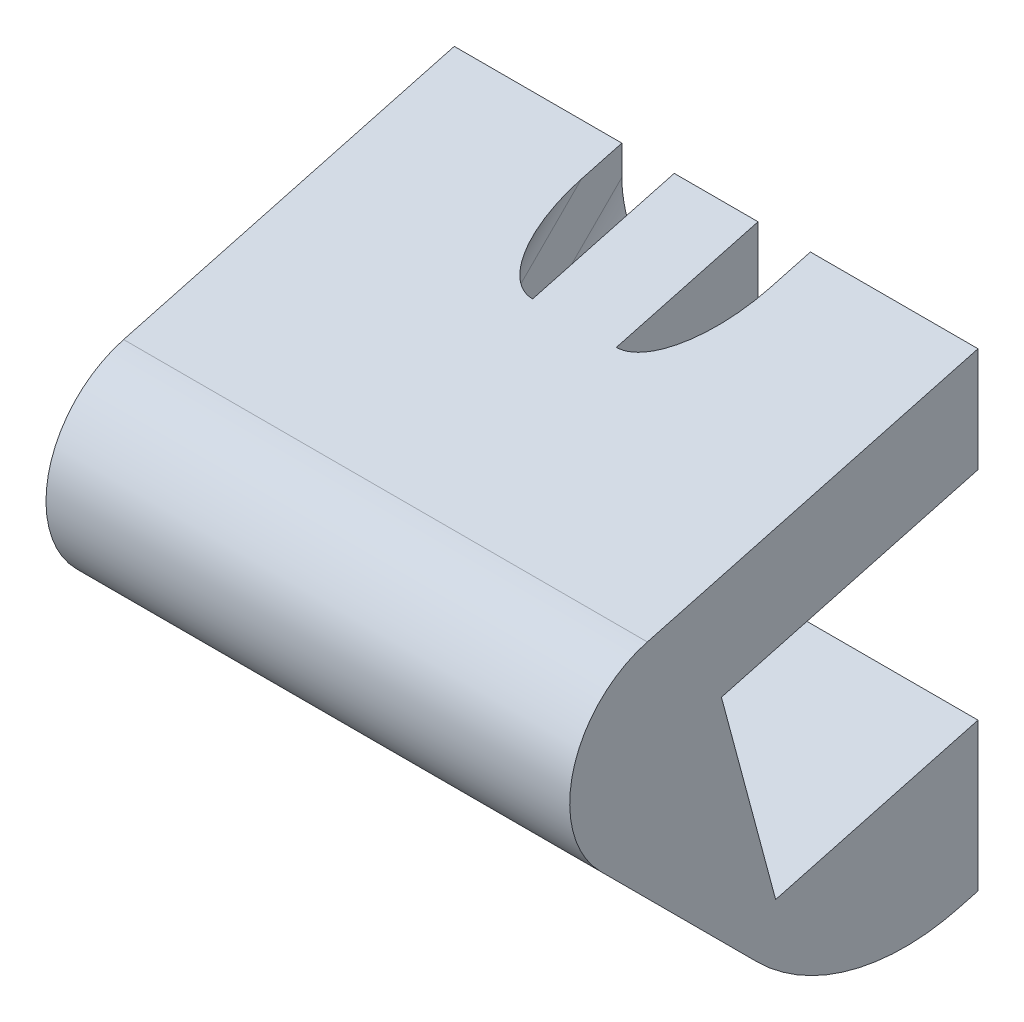
ISO-10303-21;
HEADER;
FILE_DESCRIPTION(('STEP AP214'),'2;1');
FILE_NAME('part.step','',(''),(''),'','','');
FILE_SCHEMA(('AUTOMOTIVE_DESIGN { 1 0 10303 214 1 1 1 1 }'));
ENDSEC;
DATA;
#1=APPLICATION_CONTEXT('core data for automotive mechanical design processes');
#2=APPLICATION_PROTOCOL_DEFINITION('international standard','automotive_design',2000,#1);
#3=PRODUCT_CONTEXT('',#1,'mechanical');
#4=PRODUCT('Part','Part','',(#3));
#5=PRODUCT_RELATED_PRODUCT_CATEGORY('part','',(#4));
#6=PRODUCT_DEFINITION_FORMATION('','',#4);
#7=PRODUCT_DEFINITION_CONTEXT('part definition',#1,'design');
#8=PRODUCT_DEFINITION('design','',#6,#7);
#9=PRODUCT_DEFINITION_SHAPE('','',#8);
#10=(LENGTH_UNIT() NAMED_UNIT(*) SI_UNIT(.MILLI.,.METRE.));
#11=(NAMED_UNIT(*) PLANE_ANGLE_UNIT() SI_UNIT($,.RADIAN.));
#12=(NAMED_UNIT(*) SI_UNIT($,.STERADIAN.) SOLID_ANGLE_UNIT());
#13=UNCERTAINTY_MEASURE_WITH_UNIT(LENGTH_MEASURE(1.E-05),#10,'distance_accuracy_value','');
#14=(GEOMETRIC_REPRESENTATION_CONTEXT(3) GLOBAL_UNCERTAINTY_ASSIGNED_CONTEXT((#13)) GLOBAL_UNIT_ASSIGNED_CONTEXT((#10,
#11,#12)) REPRESENTATION_CONTEXT('',''));
#15=CARTESIAN_POINT('',(0.,0.,0.));
#16=DIRECTION('',(0.,0.,1.));
#17=DIRECTION('',(1.,0.,0.));
#18=AXIS2_PLACEMENT_3D('',#15,#16,#17);
#19=CARTESIAN_POINT('',(4.064,-4.60180262192282,7.3603547963227));
#20=DIRECTION('',(1.,0.,0.));
#21=DIRECTION('',(0.,0.,-1.));
#22=AXIS2_PLACEMENT_3D('',#19,#20,#21);
#23=PLANE('',#22);
#24=DIRECTION('',(0.,0.258819045102521,-0.965925826289068));
#25=VECTOR('',#24,1.);
#26=CARTESIAN_POINT('',(4.064,0.,0.));
#27=LINE('',#26,#25);
#28=CARTESIAN_POINT('',(4.064,-0.262960149824156,0.98138063950968));
#29=VERTEX_POINT('',#28);
#30=CARTESIAN_POINT('',(4.064,0.,0.));
#31=VERTEX_POINT('',#30);
#32=EDGE_CURVE('E298',#29,#31,#27,.T.);
#33=ORIENTED_EDGE('',*,*,#32,.F.);
#34=DIRECTION('',(0.,-0.707106781186548,0.707106781186547));
#35=VECTOR('',#34,1.);
#36=CARTESIAN_POINT('',(4.064,-7.41791968849383,8.13634017817935));
#37=LINE('',#36,#35);
#38=CARTESIAN_POINT('',(4.064,-3.73266467543665,4.45108516512217));
#39=VERTEX_POINT('',#38);
#40=EDGE_CURVE('E764',#29,#39,#37,.T.);
#41=ORIENTED_EDGE('',*,*,#40,.T.);
#42=DIRECTION('',(0.,-0.258819045102522,0.965925826289068));
#43=VECTOR('',#42,1.);
#44=CARTESIAN_POINT('',(4.064,-4.20710054805557,6.22170394666926));
#45=LINE('',#44,#43);
#46=CARTESIAN_POINT('',(4.064,-3.20674437578832,2.48832388610277));
#47=VERTEX_POINT('',#46);
#48=EDGE_CURVE('E303',#47,#39,#45,.T.);
#49=ORIENTED_EDGE('',*,*,#48,.F.);
#50=DIRECTION('',(0.,-0.707106781186548,0.707106781186547));
#51=VECTOR('',#50,1.);
#52=CARTESIAN_POINT('',(4.064,-7.23831456607245,6.5198940763869));
#53=LINE('',#52,#51);
#54=CARTESIAN_POINT('',(4.064,-0.71842048968552,0.));
#55=VERTEX_POINT('',#54);
#56=EDGE_CURVE('E654',#55,#47,#53,.T.);
#57=ORIENTED_EDGE('',*,*,#56,.F.);
#58=DIRECTION('',(0.,-1.,0.));
#59=VECTOR('',#58,1.);
#60=CARTESIAN_POINT('',(4.064,-2.54,0.));
#61=LINE('',#60,#59);
#62=EDGE_CURVE('E300',#31,#55,#61,.T.);
#63=ORIENTED_EDGE('',*,*,#62,.F.);
#64=EDGE_LOOP('',(#33,#41,#49,#57,#63));
#65=FACE_BOUND('',#64,.T.);
#66=ADVANCED_FACE('F45',(#65),#23,.T.);
#67=CARTESIAN_POINT('',(8.636,-4.60180262192282,7.3603547963227));
#68=DIRECTION('',(-1.,0.,0.));
#69=DIRECTION('',(0.,0.,1.));
#70=AXIS2_PLACEMENT_3D('',#67,#68,#69);
#71=PLANE('',#70);
#72=DIRECTION('',(0.,-0.707106781186549,-0.707106781186546));
#73=VECTOR('',#72,1.);
#74=CARTESIAN_POINT('',(8.636,-11.3865084965343,4.16775137013891));
#75=LINE('',#74,#73);
#76=CARTESIAN_POINT('',(8.636,-7.41791968849383,8.13634017817935));
#77=VERTEX_POINT('',#76);
#78=CARTESIAN_POINT('',(8.636,-8.13634017817936,7.41791968849382));
#79=VERTEX_POINT('',#78);
#80=EDGE_CURVE('E352',#77,#79,#75,.T.);
#81=ORIENTED_EDGE('',*,*,#80,.F.);
#82=DIRECTION('',(0.,0.707106781186548,-0.707106781186547));
#83=VECTOR('',#82,1.);
#84=CARTESIAN_POINT('',(8.636,-1.81838613649147,2.53680662617699));
#85=LINE('',#84,#83);
#86=CARTESIAN_POINT('',(8.636,-5.22936777821399,5.94778826789951));
#87=VERTEX_POINT('',#86);
#88=EDGE_CURVE('E755',#77,#87,#85,.T.);
#89=ORIENTED_EDGE('',*,*,#88,.T.);
#90=DIRECTION('',(0.,0.965925826289069,0.25881904510252));
#91=VECTOR('',#90,1.);
#92=CARTESIAN_POINT('',(8.636,-4.20710054805556,6.22170394666926));
#93=LINE('',#92,#91);
#94=CARTESIAN_POINT('',(8.636,-6.3625685310108,5.64414804132526));
#95=VERTEX_POINT('',#94);
#96=EDGE_CURVE('E327',#95,#87,#93,.T.);
#97=ORIENTED_EDGE('',*,*,#96,.F.);
#98=DIRECTION('',(0.,-0.707106781186549,0.707106781186546));
#99=VECTOR('',#98,1.);
#100=CARTESIAN_POINT('',(8.636,-6.34028895396552,5.62186846427999));
#101=LINE('',#100,#99);
#102=EDGE_CURVE('E742',#95,#79,#101,.T.);
#103=ORIENTED_EDGE('',*,*,#102,.T.);
#104=EDGE_LOOP('',(#81,#89,#97,#103));
#105=FACE_BOUND('',#104,.T.);
#106=ADVANCED_FACE('F841',(#105),#71,.T.);
#107=CARTESIAN_POINT('',(5.334,10.1833823088017,-10.1833823088017));
#108=DIRECTION('',(1.,0.,0.));
#109=DIRECTION('',(0.,0.,-1.));
#110=AXIS2_PLACEMENT_3D('',#107,#108,#109);
#111=PLANE('',#110);
#112=DIRECTION('',(0.,-0.707106781186548,0.707106781186547));
#113=VECTOR('',#112,1.);
#114=CARTESIAN_POINT('',(5.334,-6.51989407638692,9.03436579028626));
#115=LINE('',#114,#113);
#116=CARTESIAN_POINT('',(5.334,-0.920360524384555,3.43483223828391));
#117=VERTEX_POINT('',#116);
#118=CARTESIAN_POINT('',(5.334,-5.62186846427999,8.13634017817935));
#119=VERTEX_POINT('',#118);
#120=EDGE_CURVE('E321',#117,#119,#115,.T.);
#121=ORIENTED_EDGE('',*,*,#120,.F.);
#122=DIRECTION('',(0.,-0.258819045102521,0.965925826289068));
#123=VECTOR('',#122,1.);
#124=CARTESIAN_POINT('',(5.334,-1.643500936401,6.13362899693557));
#125=LINE('',#124,#123);
#126=CARTESIAN_POINT('',(5.334,0.,0.));
#127=VERTEX_POINT('',#126);
#128=EDGE_CURVE('E612',#127,#117,#125,.T.);
#129=ORIENTED_EDGE('',*,*,#128,.F.);
#130=DIRECTION('',(0.,-1.,0.));
#131=VECTOR('',#130,1.);
#132=CARTESIAN_POINT('',(5.334,-5.69325424826713,0.));
#133=LINE('',#132,#131);
#134=CARTESIAN_POINT('',(5.334,-2.51447171389935,0.));
#135=VERTEX_POINT('',#134);
#136=EDGE_CURVE('E617',#127,#135,#133,.T.);
#137=ORIENTED_EDGE('',*,*,#136,.T.);
#138=DIRECTION('',(0.,-0.707106781186548,0.707106781186547));
#139=VECTOR('',#138,1.);
#140=CARTESIAN_POINT('',(5.334,8.92614645185204,-11.4406181657514));
#141=LINE('',#140,#139);
#142=CARTESIAN_POINT('',(5.334,-2.5493440012279,0.0348722873285334));
#143=VERTEX_POINT('',#142);
#144=EDGE_CURVE('E548',#135,#143,#141,.T.);
#145=ORIENTED_EDGE('',*,*,#144,.T.);
#146=DIRECTION('',(0.,0.258819045102521,-0.965925826289068));
#147=VECTOR('',#146,1.);
#148=CARTESIAN_POINT('',(5.334,0.858150580859396,-12.6820706195369));
#149=LINE('',#148,#147);
#150=CARTESIAN_POINT('',(5.334,-4.20710054805556,6.22170394666926));
#151=VERTEX_POINT('',#150);
#152=EDGE_CURVE('E275',#151,#143,#149,.T.);
#153=ORIENTED_EDGE('',*,*,#152,.F.);
#154=DIRECTION('',(0.,0.965925826289068,0.258819045102521));
#155=VECTOR('',#154,1.);
#156=CARTESIAN_POINT('',(5.334,5.11813117988677,8.72039225740448));
#157=LINE('',#156,#155);
#158=CARTESIAN_POINT('',(5.334,-7.77906947200681,5.26459775810744));
#159=VERTEX_POINT('',#158);
#160=EDGE_CURVE('E652',#159,#151,#157,.T.);
#161=ORIENTED_EDGE('',*,*,#160,.F.);
#162=DIRECTION('',(0.,0.707106781186547,-0.707106781186548));
#163=VECTOR('',#162,1.);
#164=CARTESIAN_POINT('',(5.334,-7.77906947200682,5.26459775810745));
#165=LINE('',#164,#163);
#166=CARTESIAN_POINT('',(5.334,-8.13634017817936,5.62186846427998));
#167=VERTEX_POINT('',#166);
#168=EDGE_CURVE('E324',#167,#159,#165,.T.);
#169=ORIENTED_EDGE('',*,*,#168,.F.);
#170=DIRECTION('',(0.,-0.707106781186547,-0.707106781186548));
#171=VECTOR('',#170,1.);
#172=CARTESIAN_POINT('',(5.334,-5.62186846427999,8.13634017817935));
#173=LINE('',#172,#171);
#174=EDGE_CURVE('E372',#119,#167,#173,.T.);
#175=ORIENTED_EDGE('',*,*,#174,.F.);
#176=EDGE_LOOP('',(#121,#129,#137,#145,#153,#161,#169,#175));
#177=FACE_BOUND('',#176,.T.);
#178=ADVANCED_FACE('F848',(#177),#111,.F.);
#179=CARTESIAN_POINT('',(7.366,10.1833823088017,-10.1833823088017));
#180=DIRECTION('',(1.,0.,0.));
#181=DIRECTION('',(0.,0.,-1.));
#182=AXIS2_PLACEMENT_3D('',#179,#180,#181);
#183=PLANE('',#182);
#184=DIRECTION('',(0.,-0.258819045102521,0.965925826289068));
#185=VECTOR('',#184,1.);
#186=CARTESIAN_POINT('',(7.366,-1.643500936401,6.13362899693557));
#187=LINE('',#186,#185);
#188=CARTESIAN_POINT('',(7.366,0.,0.));
#189=VERTEX_POINT('',#188);
#190=CARTESIAN_POINT('',(7.366,-0.920360524384555,3.43483223828391));
#191=VERTEX_POINT('',#190);
#192=EDGE_CURVE('E547',#189,#191,#187,.T.);
#193=ORIENTED_EDGE('',*,*,#192,.T.);
#194=DIRECTION('',(0.,0.707106781186548,-0.707106781186547));
#195=VECTOR('',#194,1.);
#196=CARTESIAN_POINT('',(7.366,-0.920360524384555,3.43483223828391));
#197=LINE('',#196,#195);
#198=CARTESIAN_POINT('',(7.366,-5.62186846428,8.13634017817935));
#199=VERTEX_POINT('',#198);
#200=EDGE_CURVE('E359',#199,#191,#197,.T.);
#201=ORIENTED_EDGE('',*,*,#200,.F.);
#202=DIRECTION('',(0.,-0.707106781186547,-0.707106781186548));
#203=VECTOR('',#202,1.);
#204=CARTESIAN_POINT('',(7.366,-5.62186846428,8.13634017817935));
#205=LINE('',#204,#203);
#206=CARTESIAN_POINT('',(7.366,-8.13634017817936,5.62186846427999));
#207=VERTEX_POINT('',#206);
#208=EDGE_CURVE('E369',#199,#207,#205,.T.);
#209=ORIENTED_EDGE('',*,*,#208,.T.);
#210=DIRECTION('',(0.,-0.707106781186549,0.707106781186546));
#211=VECTOR('',#210,1.);
#212=CARTESIAN_POINT('',(7.366,-9.03436579028627,6.5198940763869));
#213=LINE('',#212,#211);
#214=CARTESIAN_POINT('',(7.366,-7.77906947200681,5.26459775810744));
#215=VERTEX_POINT('',#214);
#216=EDGE_CURVE('E375',#215,#207,#213,.T.);
#217=ORIENTED_EDGE('',*,*,#216,.F.);
#218=DIRECTION('',(0.,0.965925826289068,0.258819045102521));
#219=VECTOR('',#218,1.);
#220=CARTESIAN_POINT('',(7.366,5.11813117988677,8.72039225740448));
#221=LINE('',#220,#219);
#222=CARTESIAN_POINT('',(7.366,-4.20710054805556,6.22170394666926));
#223=VERTEX_POINT('',#222);
#224=EDGE_CURVE('E722',#215,#223,#221,.T.);
#225=ORIENTED_EDGE('',*,*,#224,.T.);
#226=DIRECTION('',(0.,0.258819045102521,-0.965925826289068));
#227=VECTOR('',#226,1.);
#228=CARTESIAN_POINT('',(7.366,0.858150580859394,-12.6820706195369));
#229=LINE('',#228,#227);
#230=CARTESIAN_POINT('',(7.366,-2.5493440012279,0.0348722873285369));
#231=VERTEX_POINT('',#230);
#232=EDGE_CURVE('E1216',#223,#231,#229,.T.);
#233=ORIENTED_EDGE('',*,*,#232,.T.);
#234=DIRECTION('',(0.,-0.707106781186548,0.707106781186547));
#235=VECTOR('',#234,1.);
#236=CARTESIAN_POINT('',(7.366,8.92614645185204,-11.4406181657514));
#237=LINE('',#236,#235);
#238=CARTESIAN_POINT('',(7.366,-2.51447171389935,0.));
#239=VERTEX_POINT('',#238);
#240=EDGE_CURVE('E549',#239,#231,#237,.T.);
#241=ORIENTED_EDGE('',*,*,#240,.F.);
#242=DIRECTION('',(0.,-1.,0.));
#243=VECTOR('',#242,1.);
#244=CARTESIAN_POINT('',(7.366,-5.69325424826713,0.));
#245=LINE('',#244,#243);
#246=EDGE_CURVE('E640',#189,#239,#245,.T.);
#247=ORIENTED_EDGE('',*,*,#246,.F.);
#248=EDGE_LOOP('',(#193,#201,#209,#217,#225,#233,#241,#247));
#249=FACE_BOUND('',#248,.T.);
#250=ADVANCED_FACE('F890',(#249),#183,.T.);
#251=CARTESIAN_POINT('',(12.7,-7.79920299648322,0.));
#252=DIRECTION('',(0.,0.965925826289069,0.258819045102518));
#253=DIRECTION('',(0.,-0.258819045102518,0.965925826289069));
#254=AXIS2_PLACEMENT_3D('',#251,#252,#253);
#255=PLANE('',#254);
#256=DIRECTION('',(1.,0.,0.));
#257=VECTOR('',#256,1.);
#258=CARTESIAN_POINT('',(25.4,-9.11400374560401,4.90690319754845));
#259=LINE('',#258,#257);
#260=CARTESIAN_POINT('',(12.7,-9.11400374560401,4.90690319754846));
#261=VERTEX_POINT('',#260);
#262=CARTESIAN_POINT('',(0.,-9.11400374560401,4.90690319754845));
#263=VERTEX_POINT('',#262);
#264=EDGE_CURVE('E388',#261,#263,#259,.F.);
#265=ORIENTED_EDGE('',*,*,#264,.F.);
#266=DIRECTION('',(0.,0.258819045102518,-0.965925826289069));
#267=VECTOR('',#266,1.);
#268=CARTESIAN_POINT('',(12.7,-9.42510648350327,6.06795442176232));
#269=LINE('',#268,#267);
#270=CARTESIAN_POINT('',(12.7,-7.79920299648322,0.));
#271=VERTEX_POINT('',#270);
#272=EDGE_CURVE('E331',#271,#261,#269,.F.);
#273=ORIENTED_EDGE('',*,*,#272,.F.);
#274=DIRECTION('',(1.,0.,0.));
#275=VECTOR('',#274,1.);
#276=CARTESIAN_POINT('',(12.7,-7.79920299648322,0.));
#277=LINE('',#276,#275);
#278=CARTESIAN_POINT('',(0.,-7.79920299648322,0.));
#279=VERTEX_POINT('',#278);
#280=EDGE_CURVE('E313',#279,#271,#277,.T.);
#281=ORIENTED_EDGE('',*,*,#280,.F.);
#282=DIRECTION('',(0.,-0.258819045102518,0.965925826289069));
#283=VECTOR('',#282,1.);
#284=CARTESIAN_POINT('',(0.,-9.42510648350327,6.06795442176232));
#285=LINE('',#284,#283);
#286=EDGE_CURVE('E290',#263,#279,#285,.F.);
#287=ORIENTED_EDGE('',*,*,#286,.F.);
#288=EDGE_LOOP('',(#265,#273,#281,#287));
#289=FACE_BOUND('',#288,.T.);
#290=ADVANCED_FACE('F827',(#289),#255,.T.);
#291=CARTESIAN_POINT('',(12.7,-7.77712993333659,7.77712993333659));
#292=DIRECTION('',(0.,0.707106781186548,-0.707106781186547));
#293=DIRECTION('',(0.,0.707106781186547,0.707106781186548));
#294=AXIS2_PLACEMENT_3D('',#291,#292,#293);
#295=PLANE('',#294);
#296=ORIENTED_EDGE('',*,*,#80,.T.);
#297=CARTESIAN_POINT('',(7.366,-8.13634017817936,7.41791968849382));
#298=DIRECTION('',(0.,0.707106781186548,-0.707106781186547));
#299=DIRECTION('',(0.,0.707106781186547,0.707106781186548));
#300=AXIS2_PLACEMENT_3D('',#297,#298,#299);
#301=CIRCLE('',#300,1.27);
#302=CARTESIAN_POINT('',(7.366,-9.03436579028627,6.5198940763869));
#303=VERTEX_POINT('',#302);
#304=EDGE_CURVE('E796',#79,#303,#301,.T.);
#305=ORIENTED_EDGE('',*,*,#304,.T.);
#306=DIRECTION('',(-1.,0.,0.));
#307=VECTOR('',#306,1.);
#308=CARTESIAN_POINT('',(8.636,-9.03436579028627,6.5198940763869));
#309=LINE('',#308,#307);
#310=CARTESIAN_POINT('',(5.334,-9.03436579028627,6.5198940763869));
#311=VERTEX_POINT('',#310);
#312=EDGE_CURVE('E380',#303,#311,#309,.T.);
#313=ORIENTED_EDGE('',*,*,#312,.T.);
#314=CARTESIAN_POINT('',(5.334,-8.13634017817936,7.41791968849382));
#315=DIRECTION('',(0.,0.707106781186548,-0.707106781186547));
#316=DIRECTION('',(0.,0.707106781186547,0.707106781186548));
#317=AXIS2_PLACEMENT_3D('',#314,#315,#316);
#318=CIRCLE('',#317,1.27);
#319=CARTESIAN_POINT('',(4.064,-8.13634017817936,7.41791968849382));
#320=VERTEX_POINT('',#319);
#321=EDGE_CURVE('E785',#311,#320,#318,.T.);
#322=ORIENTED_EDGE('',*,*,#321,.T.);
#323=DIRECTION('',(0.,0.707106781186547,0.707106781186548));
#324=VECTOR('',#323,1.);
#325=CARTESIAN_POINT('',(4.064,-6.39785384613665,9.15640602053653));
#326=LINE('',#325,#324);
#327=CARTESIAN_POINT('',(4.064,-7.41791968849383,8.13634017817935));
#328=VERTEX_POINT('',#327);
#329=EDGE_CURVE('E295',#320,#328,#326,.T.);
#330=ORIENTED_EDGE('',*,*,#329,.T.);
#331=CARTESIAN_POINT('',(5.334,-7.41791968849383,8.13634017817935));
#332=DIRECTION('',(0.,0.707106781186548,-0.707106781186547));
#333=DIRECTION('',(0.,0.707106781186547,0.707106781186548));
#334=AXIS2_PLACEMENT_3D('',#331,#332,#333);
#335=CIRCLE('',#334,1.27);
#336=CARTESIAN_POINT('',(5.334,-6.51989407638692,9.03436579028626));
#337=VERTEX_POINT('',#336);
#338=EDGE_CURVE('E792',#328,#337,#335,.T.);
#339=ORIENTED_EDGE('',*,*,#338,.T.);
#340=DIRECTION('',(-1.,0.,0.));
#341=VECTOR('',#340,1.);
#342=CARTESIAN_POINT('',(7.366,-6.51989407638692,9.03436579028626));
#343=LINE('',#342,#341);
#344=CARTESIAN_POINT('',(7.366,-6.51989407638692,9.03436579028626));
#345=VERTEX_POINT('',#344);
#346=EDGE_CURVE('E366',#345,#337,#343,.T.);
#347=ORIENTED_EDGE('',*,*,#346,.F.);
#348=CARTESIAN_POINT('',(7.366,-7.41791968849383,8.13634017817935));
#349=DIRECTION('',(0.,0.707106781186548,-0.707106781186547));
#350=DIRECTION('',(0.,0.707106781186547,0.707106781186548));
#351=AXIS2_PLACEMENT_3D('',#348,#349,#350);
#352=CIRCLE('',#351,1.27);
#353=EDGE_CURVE('E781',#345,#77,#352,.T.);
#354=ORIENTED_EDGE('',*,*,#353,.T.);
#355=EDGE_LOOP('',(#296,#305,#313,#322,#330,#339,#347,#354));
#356=FACE_BOUND('',#355,.T.);
#357=DIRECTION('',(0.,0.707106781186547,0.707106781186548));
#358=VECTOR('',#357,1.);
#359=CARTESIAN_POINT('',(0.,-6.39785384613665,9.15640602053653));
#360=LINE('',#359,#358);
#361=CARTESIAN_POINT('',(0.,-10.1933566783147,5.36090318835843));
#362=VERTEX_POINT('',#361);
#363=CARTESIAN_POINT('',(0.,-6.39785384613665,9.15640602053653));
#364=VERTEX_POINT('',#363);
#365=EDGE_CURVE('E254',#362,#364,#360,.T.);
#366=ORIENTED_EDGE('',*,*,#365,.F.);
#367=DIRECTION('',(-1.,0.,0.));
#368=VECTOR('',#367,1.);
#369=CARTESIAN_POINT('',(12.7,-10.1933566783147,5.36090318835843));
#370=LINE('',#369,#368);
#371=CARTESIAN_POINT('',(12.7,-10.1933566783148,5.36090318835844));
#372=VERTEX_POINT('',#371);
#373=EDGE_CURVE('E800',#362,#372,#370,.F.);
#374=ORIENTED_EDGE('',*,*,#373,.T.);
#375=DIRECTION('',(0.,-0.707106781186549,-0.707106781186546));
#376=VECTOR('',#375,1.);
#377=CARTESIAN_POINT('',(12.7,-11.3865084965343,4.16775137013891));
#378=LINE('',#377,#376);
#379=CARTESIAN_POINT('',(12.7,-6.39785384613665,9.15640602053653));
#380=VERTEX_POINT('',#379);
#381=EDGE_CURVE('E269',#380,#372,#378,.T.);
#382=ORIENTED_EDGE('',*,*,#381,.F.);
#383=DIRECTION('',(-1.,0.,0.));
#384=VECTOR('',#383,1.);
#385=CARTESIAN_POINT('',(12.7,-6.39785384613665,9.15640602053653));
#386=LINE('',#385,#384);
#387=EDGE_CURVE('E267',#380,#364,#386,.T.);
#388=ORIENTED_EDGE('',*,*,#387,.T.);
#389=EDGE_LOOP('',(#366,#374,#382,#388));
#390=FACE_BOUND('',#389,.T.);
#391=ADVANCED_FACE('F268',(#356,#390),#295,.F.);
#392=CARTESIAN_POINT('',(25.4,-6.66055214682979,5.56430357210885));
#393=DIRECTION('',(0.,0.258819045102521,-0.965925826289068));
#394=DIRECTION('',(0.,0.965925826289068,0.258819045102521));
#395=AXIS2_PLACEMENT_3D('',#392,#393,#394);
#396=PLANE('',#395);
#397=ORIENTED_EDGE('',*,*,#224,.F.);
#398=CARTESIAN_POINT('',(7.366,-6.36256853101079,5.64414804132526));
#399=DIRECTION('',(0.,0.258819045102521,-0.965925826289068));
#400=DIRECTION('',(0.,-0.965925826289068,-0.258819045102521));
#401=AXIS2_PLACEMENT_3D('',#398,#399,#400);
#402=ELLIPSE('',#401,1.46646968374165,1.27);
#403=EDGE_CURVE('E798',#215,#95,#402,.F.);
#404=ORIENTED_EDGE('',*,*,#403,.T.);
#405=ORIENTED_EDGE('',*,*,#96,.T.);
#406=CARTESIAN_POINT('',(7.366,-5.22936777821398,5.9477882678995));
#407=DIRECTION('',(0.,0.258819045102521,-0.965925826289068));
#408=DIRECTION('',(0.,-0.965925826289068,-0.258819045102521));
#409=AXIS2_PLACEMENT_3D('',#406,#407,#408);
#410=ELLIPSE('',#409,1.46646968374165,1.27);
#411=CARTESIAN_POINT('',(8.24512168287515,-4.20710054805556,6.22170394666926));
#412=VERTEX_POINT('',#411);
#413=EDGE_CURVE('E774',#87,#412,#410,.F.);
#414=ORIENTED_EDGE('',*,*,#413,.T.);
#415=DIRECTION('',(-1.,0.,0.));
#416=VECTOR('',#415,1.);
#417=CARTESIAN_POINT('',(12.7,-4.20710054805556,6.22170394666926));
#418=LINE('',#417,#416);
#419=CARTESIAN_POINT('',(12.7,-4.20710054805556,6.22170394666926));
#420=VERTEX_POINT('',#419);
#421=EDGE_CURVE('E357',#420,#412,#418,.T.);
#422=ORIENTED_EDGE('',*,*,#421,.F.);
#423=DIRECTION('',(0.,0.965925826289069,0.25881904510252));
#424=VECTOR('',#423,1.);
#425=CARTESIAN_POINT('',(12.7,-4.20710054805556,6.22170394666926));
#426=LINE('',#425,#424);
#427=EDGE_CURVE('E328',#261,#420,#426,.T.);
#428=ORIENTED_EDGE('',*,*,#427,.F.);
#429=ORIENTED_EDGE('',*,*,#264,.T.);
#430=DIRECTION('',(0.,-0.965925826289068,-0.258819045102522));
#431=VECTOR('',#430,1.);
#432=CARTESIAN_POINT('',(0.,-7.79920299648322,5.2592029964832));
#433=LINE('',#432,#431);
#434=CARTESIAN_POINT('',(0.,-4.20710054805557,6.22170394666926));
#435=VERTEX_POINT('',#434);
#436=EDGE_CURVE('E287',#435,#263,#433,.T.);
#437=ORIENTED_EDGE('',*,*,#436,.F.);
#438=DIRECTION('',(1.,0.,0.));
#439=VECTOR('',#438,1.);
#440=CARTESIAN_POINT('',(0.,-4.20710054805557,6.22170394666926));
#441=LINE('',#440,#439);
#442=CARTESIAN_POINT('',(4.45487831712484,-4.20710054805557,6.22170394666926));
#443=VERTEX_POINT('',#442);
#444=EDGE_CURVE('E308',#435,#443,#441,.T.);
#445=ORIENTED_EDGE('',*,*,#444,.T.);
#446=CARTESIAN_POINT('',(5.334,-5.22936777821398,5.9477882678995));
#447=DIRECTION('',(0.,0.258819045102521,-0.965925826289068));
#448=DIRECTION('',(0.,0.965925826289068,0.258819045102521));
#449=AXIS2_PLACEMENT_3D('',#446,#447,#448);
#450=ELLIPSE('',#449,1.46646968374165,1.27);
#451=CARTESIAN_POINT('',(4.064,-5.22936777821399,5.94778826789951));
#452=VERTEX_POINT('',#451);
#453=EDGE_CURVE('E790',#443,#452,#450,.F.);
#454=ORIENTED_EDGE('',*,*,#453,.T.);
#455=DIRECTION('',(0.,-0.965925826289068,-0.258819045102522));
#456=VECTOR('',#455,1.);
#457=CARTESIAN_POINT('',(4.064,-7.79920299648322,5.2592029964832));
#458=LINE('',#457,#456);
#459=CARTESIAN_POINT('',(4.064,-6.36256853101079,5.64414804132526));
#460=VERTEX_POINT('',#459);
#461=EDGE_CURVE('E264',#452,#460,#458,.T.);
#462=ORIENTED_EDGE('',*,*,#461,.T.);
#463=CARTESIAN_POINT('',(5.334,-6.36256853101079,5.64414804132526));
#464=DIRECTION('',(0.,0.258819045102521,-0.965925826289068));
#465=DIRECTION('',(0.,0.965925826289068,0.258819045102521));
#466=AXIS2_PLACEMENT_3D('',#463,#464,#465);
#467=ELLIPSE('',#466,1.46646968374165,1.27);
#468=EDGE_CURVE('E783',#460,#159,#467,.F.);
#469=ORIENTED_EDGE('',*,*,#468,.T.);
#470=ORIENTED_EDGE('',*,*,#160,.T.);
#471=DIRECTION('',(-1.,0.,0.));
#472=VECTOR('',#471,1.);
#473=CARTESIAN_POINT('',(25.4,-4.20710054805556,6.22170394666926));
#474=LINE('',#473,#472);
#475=EDGE_CURVE('E383',#223,#151,#474,.T.);
#476=ORIENTED_EDGE('',*,*,#475,.F.);
#477=EDGE_LOOP('',(#397,#404,#405,#414,#422,#428,#429,#437,#445,#454,#462,#469,#470,#476));
#478=FACE_BOUND('',#477,.T.);
#479=ADVANCED_FACE('F822',(#478),#396,.T.);
#480=CARTESIAN_POINT('',(12.7,-1.643500936401,6.13362899693557));
#481=DIRECTION('',(0.,-0.965925826289068,-0.258819045102521));
#482=DIRECTION('',(0.,0.258819045102521,-0.965925826289068));
#483=AXIS2_PLACEMENT_3D('',#480,#481,#482);
#484=PLANE('',#483);
#485=DIRECTION('',(-1.,0.,0.));
#486=VECTOR('',#485,1.);
#487=CARTESIAN_POINT('',(12.7,-2.14835102314859,8.0177551708831));
#488=LINE('',#487,#486);
#489=CARTESIAN_POINT('',(0.,-2.14835102314859,8.0177551708831));
#490=VERTEX_POINT('',#489);
#491=CARTESIAN_POINT('',(12.7,-2.14835102314859,8.0177551708831));
#492=VERTEX_POINT('',#491);
#493=EDGE_CURVE('E274',#490,#492,#488,.F.);
#494=ORIENTED_EDGE('',*,*,#493,.T.);
#495=DIRECTION('',(0.,-0.258819045102521,0.965925826289068));
#496=VECTOR('',#495,1.);
#497=CARTESIAN_POINT('',(12.7,-2.14835102314859,8.0177551708831));
#498=LINE('',#497,#496);
#499=CARTESIAN_POINT('',(12.7,0.,0.));
#500=VERTEX_POINT('',#499);
#501=EDGE_CURVE('E336',#500,#492,#498,.T.);
#502=ORIENTED_EDGE('',*,*,#501,.F.);
#503=DIRECTION('',(-1.,0.,0.));
#504=VECTOR('',#503,1.);
#505=CARTESIAN_POINT('',(12.7,0.,0.));
#506=LINE('',#505,#504);
#507=CARTESIAN_POINT('',(8.636,0.,0.));
#508=VERTEX_POINT('',#507);
#509=EDGE_CURVE('E342',#500,#508,#506,.T.);
#510=ORIENTED_EDGE('',*,*,#509,.T.);
#511=DIRECTION('',(0.,-0.258819045102521,0.965925826289068));
#512=VECTOR('',#511,1.);
#513=CARTESIAN_POINT('',(8.636,-2.14835102314859,8.0177551708831));
#514=LINE('',#513,#512);
#515=CARTESIAN_POINT('',(8.636,-0.262960149824156,0.98138063950968));
#516=VERTEX_POINT('',#515);
#517=EDGE_CURVE('E349',#508,#516,#514,.T.);
#518=ORIENTED_EDGE('',*,*,#517,.T.);
#519=CARTESIAN_POINT('',(7.366,-0.262960149824152,0.981380639509676));
#520=DIRECTION('',(0.,-0.965925826289068,-0.258819045102521));
#521=DIRECTION('',(0.,-0.258819045102521,0.965925826289068));
#522=AXIS2_PLACEMENT_3D('',#519,#520,#521);
#523=ELLIPSE('',#522,2.54,1.27);
#524=EDGE_CURVE('E779',#516,#191,#523,.T.);
#525=ORIENTED_EDGE('',*,*,#524,.T.);
#526=ORIENTED_EDGE('',*,*,#192,.F.);
#527=DIRECTION('',(-1.,0.,0.));
#528=VECTOR('',#527,1.);
#529=CARTESIAN_POINT('',(12.7,0.,0.));
#530=LINE('',#529,#528);
#531=EDGE_CURVE('E647',#189,#127,#530,.T.);
#532=ORIENTED_EDGE('',*,*,#531,.T.);
#533=ORIENTED_EDGE('',*,*,#128,.T.);
#534=CARTESIAN_POINT('',(5.334,-0.262960149824152,0.981380639509676));
#535=DIRECTION('',(0.,-0.965925826289068,-0.258819045102521));
#536=DIRECTION('',(0.,0.258819045102521,-0.965925826289068));
#537=AXIS2_PLACEMENT_3D('',#534,#535,#536);
#538=ELLIPSE('',#537,2.54,1.27);
#539=EDGE_CURVE('E794',#117,#29,#538,.T.);
#540=ORIENTED_EDGE('',*,*,#539,.T.);
#541=ORIENTED_EDGE('',*,*,#32,.T.);
#542=DIRECTION('',(1.,0.,0.));
#543=VECTOR('',#542,1.);
#544=CARTESIAN_POINT('',(0.,0.,0.));
#545=LINE('',#544,#543);
#546=CARTESIAN_POINT('',(0.,0.,0.));
#547=VERTEX_POINT('',#546);
#548=EDGE_CURVE('E310',#547,#31,#545,.T.);
#549=ORIENTED_EDGE('',*,*,#548,.F.);
#550=DIRECTION('',(0.,0.258819045102521,-0.965925826289068));
#551=VECTOR('',#550,1.);
#552=CARTESIAN_POINT('',(0.,0.,0.));
#553=LINE('',#552,#551);
#554=EDGE_CURVE('E278',#490,#547,#553,.T.);
#555=ORIENTED_EDGE('',*,*,#554,.F.);
#556=EDGE_LOOP('',(#494,#502,#510,#518,#525,#526,#532,#533,#540,#541,#549,#555));
#557=FACE_BOUND('',#556,.T.);
#558=ADVANCED_FACE('F808',(#557),#484,.F.);
#559=CARTESIAN_POINT('',(12.7,-4.60180262192282,7.3603547963227));
#560=DIRECTION('',(-1.,0.,0.));
#561=DIRECTION('',(0.,0.,1.));
#562=AXIS2_PLACEMENT_3D('',#559,#560,#561);
#563=CYLINDRICAL_SURFACE('',#562,2.54);
#564=ORIENTED_EDGE('',*,*,#387,.F.);
#565=CARTESIAN_POINT('',(12.7,-4.60180262192282,7.3603547963227));
#566=DIRECTION('',(1.,0.,0.));
#567=DIRECTION('',(0.,0.,1.));
#568=AXIS2_PLACEMENT_3D('',#565,#566,#567);
#569=CIRCLE('',#568,2.54);
#570=EDGE_CURVE('E339',#492,#380,#569,.T.);
#571=ORIENTED_EDGE('',*,*,#570,.F.);
#572=ORIENTED_EDGE('',*,*,#493,.F.);
#573=CARTESIAN_POINT('',(0.,-4.60180262192282,7.3603547963227));
#574=DIRECTION('',(-1.,0.,0.));
#575=DIRECTION('',(0.,0.,-1.));
#576=AXIS2_PLACEMENT_3D('',#573,#574,#575);
#577=CIRCLE('',#576,2.54);
#578=EDGE_CURVE('E258',#364,#490,#577,.T.);
#579=ORIENTED_EDGE('',*,*,#578,.F.);
#580=EDGE_LOOP('',(#564,#571,#572,#579));
#581=FACE_BOUND('',#580,.T.);
#582=ADVANCED_FACE('F277',(#581),#563,.T.);
#583=CARTESIAN_POINT('',(12.7,-5.69325424826713,0.));
#584=DIRECTION('',(0.,0.,-1.));
#585=DIRECTION('',(-1.,0.,0.));
#586=AXIS2_PLACEMENT_3D('',#583,#584,#585);
#587=PLANE('',#586);
#588=CARTESIAN_POINT('',(7.366,-0.71842048968552,0.));
#589=DIRECTION('',(0.,0.,-1.));
#590=DIRECTION('',(0.,-1.,0.));
#591=AXIS2_PLACEMENT_3D('',#588,#589,#590);
#592=ELLIPSE('',#591,1.79605122421383,1.27);
#593=CARTESIAN_POINT('',(8.636,-0.718420489685522,0.));
#594=VERTEX_POINT('',#593);
#595=EDGE_CURVE('E542',#594,#239,#592,.T.);
#596=ORIENTED_EDGE('',*,*,#595,.F.);
#597=DIRECTION('',(0.,1.,0.));
#598=VECTOR('',#597,1.);
#599=CARTESIAN_POINT('',(8.636,0.,0.));
#600=LINE('',#599,#598);
#601=EDGE_CURVE('E347',#594,#508,#600,.T.);
#602=ORIENTED_EDGE('',*,*,#601,.T.);
#603=ORIENTED_EDGE('',*,*,#509,.F.);
#604=DIRECTION('',(0.,1.,0.));
#605=VECTOR('',#604,1.);
#606=CARTESIAN_POINT('',(12.7,0.,0.));
#607=LINE('',#606,#605);
#608=CARTESIAN_POINT('',(12.7,-2.54,0.));
#609=VERTEX_POINT('',#608);
#610=EDGE_CURVE('E334',#609,#500,#607,.T.);
#611=ORIENTED_EDGE('',*,*,#610,.F.);
#612=DIRECTION('',(-1.,0.,0.));
#613=VECTOR('',#612,1.);
#614=CARTESIAN_POINT('',(25.4,-2.54,0.));
#615=LINE('',#614,#613);
#616=CARTESIAN_POINT('',(0.,-2.54,0.));
#617=VERTEX_POINT('',#616);
#618=EDGE_CURVE('E389',#609,#617,#615,.T.);
#619=ORIENTED_EDGE('',*,*,#618,.T.);
#620=DIRECTION('',(0.,-1.,0.));
#621=VECTOR('',#620,1.);
#622=CARTESIAN_POINT('',(0.,-2.54,0.));
#623=LINE('',#622,#621);
#624=EDGE_CURVE('E280',#547,#617,#623,.T.);
#625=ORIENTED_EDGE('',*,*,#624,.F.);
#626=ORIENTED_EDGE('',*,*,#548,.T.);
#627=ORIENTED_EDGE('',*,*,#62,.T.);
#628=CARTESIAN_POINT('',(5.334,-0.71842048968552,0.));
#629=DIRECTION('',(0.,0.,-1.));
#630=DIRECTION('',(0.,-1.,0.));
#631=AXIS2_PLACEMENT_3D('',#628,#629,#630);
#632=ELLIPSE('',#631,1.79605122421383,1.27);
#633=EDGE_CURVE('E618',#135,#55,#632,.T.);
#634=ORIENTED_EDGE('',*,*,#633,.F.);
#635=ORIENTED_EDGE('',*,*,#136,.F.);
#636=ORIENTED_EDGE('',*,*,#531,.F.);
#637=ORIENTED_EDGE('',*,*,#246,.T.);
#638=EDGE_LOOP('',(#596,#602,#603,#611,#619,#625,#626,#627,#634,#635,#636,#637));
#639=FACE_BOUND('',#638,.T.);
#640=ADVANCED_FACE('F941',(#639),#587,.T.);
#641=CARTESIAN_POINT('',(25.4,-3.37355027402778,3.11085197333461));
#642=DIRECTION('',(0.,-0.965925826289068,-0.258819045102521));
#643=DIRECTION('',(0.,0.258819045102521,-0.965925826289068));
#644=AXIS2_PLACEMENT_3D('',#641,#642,#643);
#645=PLANE('',#644);
#646=ORIENTED_EDGE('',*,*,#618,.F.);
#647=DIRECTION('',(0.,0.25881904510252,-0.965925826289069));
#648=VECTOR('',#647,1.);
#649=CARTESIAN_POINT('',(12.7,-2.54,0.));
#650=LINE('',#649,#648);
#651=EDGE_CURVE('E330',#420,#609,#650,.T.);
#652=ORIENTED_EDGE('',*,*,#651,.F.);
#653=ORIENTED_EDGE('',*,*,#421,.T.);
#654=CARTESIAN_POINT('',(7.366,-3.73266467543663,4.45108516512215));
#655=DIRECTION('',(0.,-0.965925826289068,-0.258819045102521));
#656=DIRECTION('',(0.,-0.258819045102521,0.965925826289068));
#657=AXIS2_PLACEMENT_3D('',#654,#655,#656);
#658=ELLIPSE('',#657,2.54,1.27);
#659=CARTESIAN_POINT('',(8.636,-3.73266467543663,4.45108516512215));
#660=VERTEX_POINT('',#659);
#661=EDGE_CURVE('E777',#412,#660,#658,.F.);
#662=ORIENTED_EDGE('',*,*,#661,.T.);
#663=DIRECTION('',(0.,0.25881904510252,-0.965925826289069));
#664=VECTOR('',#663,1.);
#665=CARTESIAN_POINT('',(8.636,-2.54,0.));
#666=LINE('',#665,#664);
#667=CARTESIAN_POINT('',(8.636,-3.20674437578831,2.48832388610277));
#668=VERTEX_POINT('',#667);
#669=EDGE_CURVE('E345',#660,#668,#666,.T.);
#670=ORIENTED_EDGE('',*,*,#669,.T.);
#671=CARTESIAN_POINT('',(7.366,-3.20674437578831,2.48832388610277));
#672=DIRECTION('',(0.,-0.965925826289068,-0.258819045102521));
#673=DIRECTION('',(0.,-0.258819045102521,0.965925826289068));
#674=AXIS2_PLACEMENT_3D('',#671,#672,#673);
#675=ELLIPSE('',#674,2.54,1.27);
#676=EDGE_CURVE('E679',#668,#231,#675,.F.);
#677=ORIENTED_EDGE('',*,*,#676,.T.);
#678=ORIENTED_EDGE('',*,*,#232,.F.);
#679=ORIENTED_EDGE('',*,*,#475,.T.);
#680=ORIENTED_EDGE('',*,*,#152,.T.);
#681=CARTESIAN_POINT('',(5.334,-3.20674437578831,2.48832388610277));
#682=DIRECTION('',(0.,-0.965925826289068,-0.258819045102521));
#683=DIRECTION('',(0.,-0.258819045102521,0.965925826289068));
#684=AXIS2_PLACEMENT_3D('',#681,#682,#683);
#685=ELLIPSE('',#684,2.54,1.27);
#686=EDGE_CURVE('E726',#143,#47,#685,.F.);
#687=ORIENTED_EDGE('',*,*,#686,.T.);
#688=ORIENTED_EDGE('',*,*,#48,.T.);
#689=CARTESIAN_POINT('',(5.334,-3.73266467543663,4.45108516512215));
#690=DIRECTION('',(0.,-0.965925826289068,-0.258819045102521));
#691=DIRECTION('',(0.,0.258819045102521,-0.965925826289068));
#692=AXIS2_PLACEMENT_3D('',#689,#690,#691);
#693=ELLIPSE('',#692,2.54,1.27);
#694=EDGE_CURVE('E787',#39,#443,#693,.F.);
#695=ORIENTED_EDGE('',*,*,#694,.T.);
#696=ORIENTED_EDGE('',*,*,#444,.F.);
#697=DIRECTION('',(0.,-0.258819045102522,0.965925826289068));
#698=VECTOR('',#697,1.);
#699=CARTESIAN_POINT('',(0.,-4.20710054805557,6.22170394666926));
#700=LINE('',#699,#698);
#701=EDGE_CURVE('E285',#617,#435,#700,.T.);
#702=ORIENTED_EDGE('',*,*,#701,.F.);
#703=EDGE_LOOP('',(#646,#652,#653,#662,#670,#677,#678,#679,#680,#687,#688,#695,#696,#702));
#704=FACE_BOUND('',#703,.T.);
#705=ADVANCED_FACE('F816',(#704),#645,.T.);
#706=CARTESIAN_POINT('',(5.334,-7.23831456607245,6.5198940763869));
#707=DIRECTION('',(0.,-0.707106781186548,0.707106781186547));
#708=DIRECTION('',(0.,-0.707106781186547,-0.707106781186548));
#709=AXIS2_PLACEMENT_3D('',#706,#707,#708);
#710=CYLINDRICAL_SURFACE('',#709,1.27);
#711=ORIENTED_EDGE('',*,*,#686,.F.);
#712=ORIENTED_EDGE('',*,*,#144,.F.);
#713=ORIENTED_EDGE('',*,*,#633,.T.);
#714=ORIENTED_EDGE('',*,*,#56,.T.);
#715=EDGE_LOOP('',(#711,#712,#713,#714));
#716=FACE_BOUND('',#715,.T.);
#717=ADVANCED_FACE('F940',(#716),#710,.F.);
#718=CARTESIAN_POINT('',(7.366,-7.23831456607245,6.5198940763869));
#719=DIRECTION('',(0.,-0.707106781186548,0.707106781186547));
#720=DIRECTION('',(0.,-0.707106781186547,-0.707106781186548));
#721=AXIS2_PLACEMENT_3D('',#718,#719,#720);
#722=CYLINDRICAL_SURFACE('',#721,1.27);
#723=ORIENTED_EDGE('',*,*,#676,.F.);
#724=DIRECTION('',(0.,-0.707106781186548,0.707106781186547));
#725=VECTOR('',#724,1.);
#726=CARTESIAN_POINT('',(8.636,-7.23831456607245,6.5198940763869));
#727=LINE('',#726,#725);
#728=EDGE_CURVE('E653',#594,#668,#727,.T.);
#729=ORIENTED_EDGE('',*,*,#728,.F.);
#730=ORIENTED_EDGE('',*,*,#595,.T.);
#731=ORIENTED_EDGE('',*,*,#240,.T.);
#732=EDGE_LOOP('',(#723,#729,#730,#731));
#733=FACE_BOUND('',#732,.T.);
#734=ADVANCED_FACE('F957',(#733),#722,.F.);
#735=CARTESIAN_POINT('',(8.636,-9.03436579028627,6.5198940763869));
#736=DIRECTION('',(0.,-0.707106781186546,-0.707106781186549));
#737=DIRECTION('',(0.,0.707106781186549,-0.707106781186546));
#738=AXIS2_PLACEMENT_3D('',#735,#736,#737);
#739=PLANE('',#738);
#740=DIRECTION('',(1.,0.,0.));
#741=VECTOR('',#740,1.);
#742=CARTESIAN_POINT('',(5.334,-8.13634017817935,5.62186846427998));
#743=LINE('',#742,#741);
#744=EDGE_CURVE('E362',#167,#207,#743,.T.);
#745=ORIENTED_EDGE('',*,*,#744,.F.);
#746=DIRECTION('',(0.,0.707106781186549,-0.707106781186546));
#747=VECTOR('',#746,1.);
#748=CARTESIAN_POINT('',(5.334,-9.03436579028627,6.5198940763869));
#749=LINE('',#748,#747);
#750=EDGE_CURVE('E772',#167,#311,#749,.F.);
#751=ORIENTED_EDGE('',*,*,#750,.T.);
#752=ORIENTED_EDGE('',*,*,#312,.F.);
#753=DIRECTION('',(0.,-0.707106781186549,0.707106781186546));
#754=VECTOR('',#753,1.);
#755=CARTESIAN_POINT('',(7.366,-9.03436579028627,6.5198940763869));
#756=LINE('',#755,#754);
#757=EDGE_CURVE('E770',#303,#207,#756,.F.);
#758=ORIENTED_EDGE('',*,*,#757,.T.);
#759=EDGE_LOOP('',(#745,#751,#752,#758));
#760=FACE_BOUND('',#759,.T.);
#761=ADVANCED_FACE('F951',(#760),#739,.F.);
#762=CARTESIAN_POINT('',(5.334,-5.62186846427999,8.13634017817935));
#763=DIRECTION('',(0.,0.707106781186548,-0.707106781186547));
#764=DIRECTION('',(0.,0.707106781186547,0.707106781186548));
#765=AXIS2_PLACEMENT_3D('',#762,#763,#764);
#766=PLANE('',#765);
#767=ORIENTED_EDGE('',*,*,#744,.T.);
#768=ORIENTED_EDGE('',*,*,#208,.F.);
#769=DIRECTION('',(1.,0.,0.));
#770=VECTOR('',#769,1.);
#771=CARTESIAN_POINT('',(5.334,-5.62186846427999,8.13634017817935));
#772=LINE('',#771,#770);
#773=EDGE_CURVE('E363',#119,#199,#772,.T.);
#774=ORIENTED_EDGE('',*,*,#773,.F.);
#775=ORIENTED_EDGE('',*,*,#174,.T.);
#776=EDGE_LOOP('',(#767,#768,#774,#775));
#777=FACE_BOUND('',#776,.T.);
#778=ADVANCED_FACE('F956',(#777),#766,.F.);
#779=CARTESIAN_POINT('',(0.,1.25723585694968,1.25723585694968));
#780=DIRECTION('',(0.,-0.707106781186547,-0.707106781186548));
#781=DIRECTION('',(0.,0.707106781186548,-0.707106781186547));
#782=AXIS2_PLACEMENT_3D('',#779,#780,#781);
#783=PLANE('',#782);
#784=ORIENTED_EDGE('',*,*,#773,.T.);
#785=DIRECTION('',(0.,0.707106781186548,-0.707106781186547));
#786=VECTOR('',#785,1.);
#787=CARTESIAN_POINT('',(7.366,-6.51989407638692,9.03436579028626));
#788=LINE('',#787,#786);
#789=EDGE_CURVE('E760',#199,#345,#788,.F.);
#790=ORIENTED_EDGE('',*,*,#789,.T.);
#791=ORIENTED_EDGE('',*,*,#346,.T.);
#792=DIRECTION('',(0.,-0.707106781186548,0.707106781186547));
#793=VECTOR('',#792,1.);
#794=CARTESIAN_POINT('',(5.334,-0.920360524384559,3.43483223828391));
#795=LINE('',#794,#793);
#796=EDGE_CURVE('E758',#337,#119,#795,.F.);
#797=ORIENTED_EDGE('',*,*,#796,.T.);
#798=EDGE_LOOP('',(#784,#790,#791,#797));
#799=FACE_BOUND('',#798,.T.);
#800=ADVANCED_FACE('F970',(#799),#783,.T.);
#801=ORIENTED_EDGE('',*,*,#669,.F.);
#802=DIRECTION('',(0.,0.707106781186548,-0.707106781186547));
#803=VECTOR('',#802,1.);
#804=CARTESIAN_POINT('',(8.636,-1.81838613649147,2.53680662617699));
#805=LINE('',#804,#803);
#806=EDGE_CURVE('E753',#660,#516,#805,.T.);
#807=ORIENTED_EDGE('',*,*,#806,.T.);
#808=ORIENTED_EDGE('',*,*,#517,.F.);
#809=ORIENTED_EDGE('',*,*,#601,.F.);
#810=ORIENTED_EDGE('',*,*,#728,.T.);
#811=EDGE_LOOP('',(#801,#807,#808,#809,#810));
#812=FACE_BOUND('',#811,.T.);
#813=ADVANCED_FACE('F851',(#812),#71,.T.);
#814=CARTESIAN_POINT('',(12.7,-4.60180262192282,7.3603547963227));
#815=DIRECTION('',(-1.,0.,0.));
#816=DIRECTION('',(0.,0.,1.));
#817=AXIS2_PLACEMENT_3D('',#814,#815,#816);
#818=PLANE('',#817);
#819=ORIENTED_EDGE('',*,*,#381,.T.);
#820=CARTESIAN_POINT('',(12.7,-6.60125422988708,1.76880073993077));
#821=DIRECTION('',(-1.,0.,0.));
#822=DIRECTION('',(0.,0.,1.));
#823=AXIS2_PLACEMENT_3D('',#820,#821,#822);
#824=CIRCLE('',#823,5.08);
#825=CARTESIAN_POINT('',(12.7,-11.5081574274355,0.453999990809946));
#826=VERTEX_POINT('',#825);
#827=EDGE_CURVE('E67',#372,#826,#824,.F.);
#828=ORIENTED_EDGE('',*,*,#827,.T.);
#829=DIRECTION('',(0.,0.258819045102525,-0.965925826289067));
#830=VECTOR('',#829,1.);
#831=CARTESIAN_POINT('',(12.7,-11.3865084965343,0.));
#832=LINE('',#831,#830);
#833=CARTESIAN_POINT('',(12.7,-11.3865084965343,0.));
#834=VERTEX_POINT('',#833);
#835=EDGE_CURVE('E320',#834,#826,#832,.F.);
#836=ORIENTED_EDGE('',*,*,#835,.F.);
#837=DIRECTION('',(0.,-1.,0.));
#838=VECTOR('',#837,1.);
#839=CARTESIAN_POINT('',(12.7,-11.3865084965343,0.));
#840=LINE('',#839,#838);
#841=EDGE_CURVE('E316',#271,#834,#840,.T.);
#842=ORIENTED_EDGE('',*,*,#841,.F.);
#843=ORIENTED_EDGE('',*,*,#272,.T.);
#844=ORIENTED_EDGE('',*,*,#427,.T.);
#845=ORIENTED_EDGE('',*,*,#651,.T.);
#846=ORIENTED_EDGE('',*,*,#610,.T.);
#847=ORIENTED_EDGE('',*,*,#501,.T.);
#848=ORIENTED_EDGE('',*,*,#570,.T.);
#849=EDGE_LOOP('',(#819,#828,#836,#842,#843,#844,#845,#846,#847,#848));
#850=FACE_BOUND('',#849,.T.);
#851=ADVANCED_FACE('F803',(#850),#818,.F.);
#852=CARTESIAN_POINT('',(4.064,-11.3865084965343,0.));
#853=DIRECTION('',(0.,-0.965925826289067,-0.258819045102525));
#854=DIRECTION('',(0.,0.258819045102525,-0.965925826289067));
#855=AXIS2_PLACEMENT_3D('',#852,#853,#854);
#856=PLANE('',#855);
#857=ORIENTED_EDGE('',*,*,#835,.T.);
#858=DIRECTION('',(1.,0.,0.));
#859=VECTOR('',#858,1.);
#860=CARTESIAN_POINT('',(4.064,-11.5081574274355,0.453999990809945));
#861=LINE('',#860,#859);
#862=CARTESIAN_POINT('',(0.,-11.5081574274355,0.453999990809945));
#863=VERTEX_POINT('',#862);
#864=EDGE_CURVE('E53',#826,#863,#861,.F.);
#865=ORIENTED_EDGE('',*,*,#864,.T.);
#866=DIRECTION('',(0.,0.258819045102525,-0.965925826289067));
#867=VECTOR('',#866,1.);
#868=CARTESIAN_POINT('',(0.,-12.7721080806188,5.1711280467495));
#869=LINE('',#868,#867);
#870=CARTESIAN_POINT('',(0.,-11.3865084965343,0.));
#871=VERTEX_POINT('',#870);
#872=EDGE_CURVE('E294',#871,#863,#869,.F.);
#873=ORIENTED_EDGE('',*,*,#872,.F.);
#874=DIRECTION('',(-1.,0.,0.));
#875=VECTOR('',#874,1.);
#876=CARTESIAN_POINT('',(4.064,-11.3865084965343,0.));
#877=LINE('',#876,#875);
#878=EDGE_CURVE('E318',#834,#871,#877,.T.);
#879=ORIENTED_EDGE('',*,*,#878,.F.);
#880=EDGE_LOOP('',(#857,#865,#873,#879));
#881=FACE_BOUND('',#880,.T.);
#882=ADVANCED_FACE('F832',(#881),#856,.T.);
#883=CARTESIAN_POINT('',(0.,0.,0.));
#884=DIRECTION('',(0.,0.,1.));
#885=DIRECTION('',(1.,0.,0.));
#886=AXIS2_PLACEMENT_3D('',#883,#884,#885);
#887=PLANE('',#886);
#888=ORIENTED_EDGE('',*,*,#280,.T.);
#889=ORIENTED_EDGE('',*,*,#841,.T.);
#890=ORIENTED_EDGE('',*,*,#878,.T.);
#891=DIRECTION('',(0.,-1.,0.));
#892=VECTOR('',#891,1.);
#893=CARTESIAN_POINT('',(0.,-11.3865084965343,0.));
#894=LINE('',#893,#892);
#895=EDGE_CURVE('E291',#279,#871,#894,.T.);
#896=ORIENTED_EDGE('',*,*,#895,.F.);
#897=EDGE_LOOP('',(#888,#889,#890,#896));
#898=FACE_BOUND('',#897,.T.);
#899=ADVANCED_FACE('F830',(#898),#887,.F.);
#900=ORIENTED_EDGE('',*,*,#329,.F.);
#901=DIRECTION('',(0.,0.707106781186549,-0.707106781186546));
#902=VECTOR('',#901,1.);
#903=CARTESIAN_POINT('',(4.064,-6.34028895396552,5.62186846427999));
#904=LINE('',#903,#902);
#905=EDGE_CURVE('E767',#320,#460,#904,.T.);
#906=ORIENTED_EDGE('',*,*,#905,.T.);
#907=ORIENTED_EDGE('',*,*,#461,.F.);
#908=DIRECTION('',(0.,-0.707106781186548,0.707106781186547));
#909=VECTOR('',#908,1.);
#910=CARTESIAN_POINT('',(4.064,-7.41791968849383,8.13634017817935));
#911=LINE('',#910,#909);
#912=EDGE_CURVE('E762',#452,#328,#911,.T.);
#913=ORIENTED_EDGE('',*,*,#912,.T.);
#914=EDGE_LOOP('',(#900,#906,#907,#913));
#915=FACE_BOUND('',#914,.T.);
#916=ADVANCED_FACE('F844',(#915),#23,.T.);
#917=CARTESIAN_POINT('',(0.,-4.60180262192282,7.3603547963227));
#918=DIRECTION('',(1.,0.,0.));
#919=DIRECTION('',(0.,0.,-1.));
#920=AXIS2_PLACEMENT_3D('',#917,#918,#919);
#921=PLANE('',#920);
#922=ORIENTED_EDGE('',*,*,#872,.T.);
#923=CARTESIAN_POINT('',(0.,-6.60125422988708,1.76880073993077));
#924=DIRECTION('',(1.,0.,0.));
#925=DIRECTION('',(0.,0.,-1.));
#926=AXIS2_PLACEMENT_3D('',#923,#924,#925);
#927=CIRCLE('',#926,5.08);
#928=EDGE_CURVE('E12',#863,#362,#927,.F.);
#929=ORIENTED_EDGE('',*,*,#928,.T.);
#930=ORIENTED_EDGE('',*,*,#365,.T.);
#931=ORIENTED_EDGE('',*,*,#578,.T.);
#932=ORIENTED_EDGE('',*,*,#554,.T.);
#933=ORIENTED_EDGE('',*,*,#624,.T.);
#934=ORIENTED_EDGE('',*,*,#701,.T.);
#935=ORIENTED_EDGE('',*,*,#436,.T.);
#936=ORIENTED_EDGE('',*,*,#286,.T.);
#937=ORIENTED_EDGE('',*,*,#895,.T.);
#938=EDGE_LOOP('',(#922,#929,#930,#931,#932,#933,#934,#935,#936,#937));
#939=FACE_BOUND('',#938,.T.);
#940=ADVANCED_FACE('F256',(#939),#921,.F.);
#941=CARTESIAN_POINT('',(7.366,-5.62186846428,6.34028895396552));
#942=DIRECTION('',(0.,-0.707106781186548,0.707106781186547));
#943=DIRECTION('',(0.,-0.707106781186547,-0.707106781186548));
#944=AXIS2_PLACEMENT_3D('',#941,#942,#943);
#945=CYLINDRICAL_SURFACE('',#944,1.27);
#946=ORIENTED_EDGE('',*,*,#789,.F.);
#947=ORIENTED_EDGE('',*,*,#200,.T.);
#948=ORIENTED_EDGE('',*,*,#524,.F.);
#949=ORIENTED_EDGE('',*,*,#806,.F.);
#950=ORIENTED_EDGE('',*,*,#661,.F.);
#951=ORIENTED_EDGE('',*,*,#413,.F.);
#952=ORIENTED_EDGE('',*,*,#88,.F.);
#953=ORIENTED_EDGE('',*,*,#353,.F.);
#954=EDGE_LOOP('',(#946,#947,#948,#949,#950,#951,#952,#953));
#955=FACE_BOUND('',#954,.T.);
#956=ADVANCED_FACE('F861',(#955),#945,.F.);
#957=CARTESIAN_POINT('',(5.334,-6.34028895396552,5.62186846427999));
#958=DIRECTION('',(0.,0.707106781186549,-0.707106781186546));
#959=DIRECTION('',(0.,0.707106781186546,0.707106781186549));
#960=AXIS2_PLACEMENT_3D('',#957,#958,#959);
#961=CYLINDRICAL_SURFACE('',#960,1.27);
#962=ORIENTED_EDGE('',*,*,#750,.F.);
#963=ORIENTED_EDGE('',*,*,#168,.T.);
#964=ORIENTED_EDGE('',*,*,#468,.F.);
#965=ORIENTED_EDGE('',*,*,#905,.F.);
#966=ORIENTED_EDGE('',*,*,#321,.F.);
#967=EDGE_LOOP('',(#962,#963,#964,#965,#966));
#968=FACE_BOUND('',#967,.T.);
#969=ADVANCED_FACE('F871',(#968),#961,.F.);
#970=CARTESIAN_POINT('',(5.334,-5.62186846428,6.34028895396552));
#971=DIRECTION('',(0.,0.707106781186548,-0.707106781186547));
#972=DIRECTION('',(0.,0.707106781186547,0.707106781186548));
#973=AXIS2_PLACEMENT_3D('',#970,#971,#972);
#974=CYLINDRICAL_SURFACE('',#973,1.27);
#975=ORIENTED_EDGE('',*,*,#120,.T.);
#976=ORIENTED_EDGE('',*,*,#796,.F.);
#977=ORIENTED_EDGE('',*,*,#338,.F.);
#978=ORIENTED_EDGE('',*,*,#912,.F.);
#979=ORIENTED_EDGE('',*,*,#453,.F.);
#980=ORIENTED_EDGE('',*,*,#694,.F.);
#981=ORIENTED_EDGE('',*,*,#40,.F.);
#982=ORIENTED_EDGE('',*,*,#539,.F.);
#983=EDGE_LOOP('',(#975,#976,#977,#978,#979,#980,#981,#982));
#984=FACE_BOUND('',#983,.T.);
#985=ADVANCED_FACE('F838',(#984),#974,.F.);
#986=CARTESIAN_POINT('',(7.366,-6.34028895396552,5.62186846427999));
#987=DIRECTION('',(0.,-0.707106781186549,0.707106781186546));
#988=DIRECTION('',(0.,-0.707106781186546,-0.707106781186549));
#989=AXIS2_PLACEMENT_3D('',#986,#987,#988);
#990=CYLINDRICAL_SURFACE('',#989,1.27);
#991=ORIENTED_EDGE('',*,*,#216,.T.);
#992=ORIENTED_EDGE('',*,*,#757,.F.);
#993=ORIENTED_EDGE('',*,*,#304,.F.);
#994=ORIENTED_EDGE('',*,*,#102,.F.);
#995=ORIENTED_EDGE('',*,*,#403,.F.);
#996=EDGE_LOOP('',(#991,#992,#993,#994,#995));
#997=FACE_BOUND('',#996,.T.);
#998=ADVANCED_FACE('F834',(#997),#990,.F.);
#999=CARTESIAN_POINT('',(12.7,-6.60125422988708,1.76880073993077));
#1000=DIRECTION('',(-1.,0.,0.));
#1001=DIRECTION('',(0.,0.,1.));
#1002=AXIS2_PLACEMENT_3D('',#999,#1000,#1001);
#1003=CYLINDRICAL_SURFACE('',#1002,5.08);
#1004=ORIENTED_EDGE('',*,*,#928,.F.);
#1005=ORIENTED_EDGE('',*,*,#864,.F.);
#1006=ORIENTED_EDGE('',*,*,#827,.F.);
#1007=ORIENTED_EDGE('',*,*,#373,.F.);
#1008=EDGE_LOOP('',(#1004,#1005,#1006,#1007));
#1009=FACE_BOUND('',#1008,.T.);
#1010=ADVANCED_FACE('F47',(#1009),#1003,.T.);
#1011=CLOSED_SHELL('',(#66,#106,#178,#250,#290,#391,#479,#558,#582,#640,#705,#717,#734,#761,
#778,#800,#813,#851,#882,#899,#916,#940,#956,#969,#985,#998,#1010));
#1012=MANIFOLD_SOLID_BREP('B2',#1011);
#1013=ADVANCED_BREP_SHAPE_REPRESENTATION('',(#18,#1012),#14);
#1014=SHAPE_DEFINITION_REPRESENTATION(#9,#1013);
ENDSEC;
END-ISO-10303-21;
